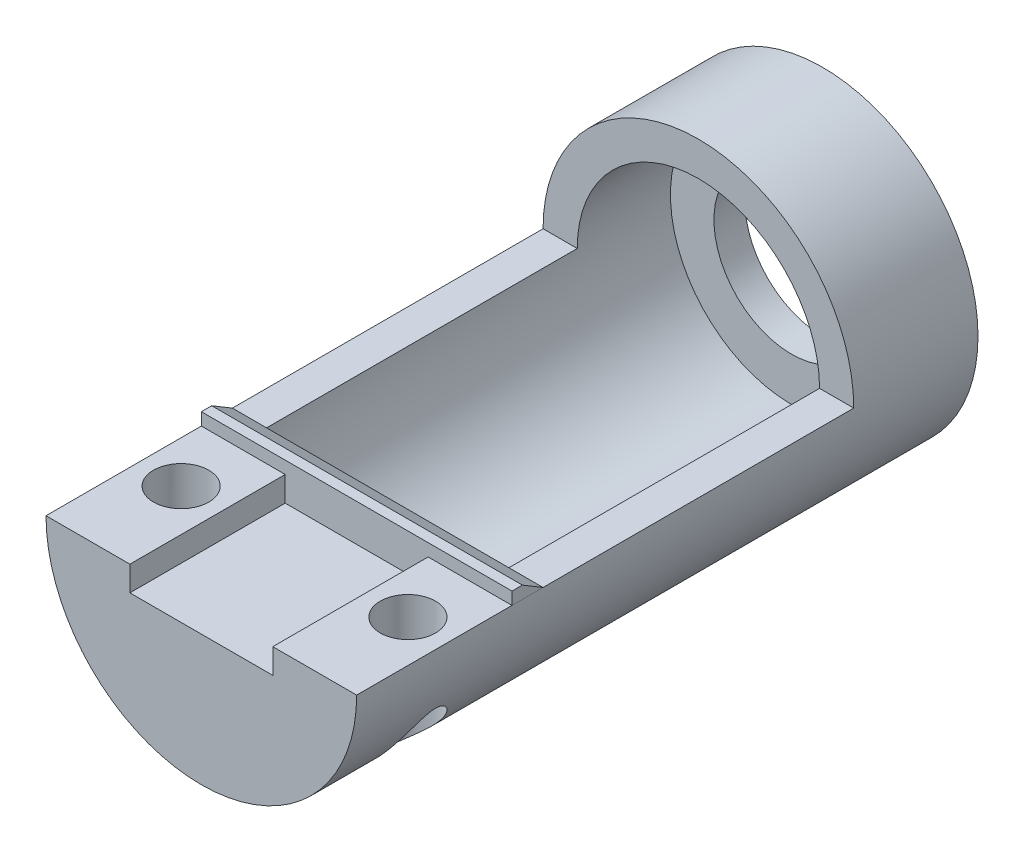
ISO-10303-21;
HEADER;
FILE_DESCRIPTION(('STEP AP214'),'2;1');
FILE_NAME('part.step','',(''),(''),'','','');
FILE_SCHEMA(('AUTOMOTIVE_DESIGN { 1 0 10303 214 1 1 1 1 }'));
ENDSEC;
DATA;
#1=APPLICATION_CONTEXT('core data for automotive mechanical design processes');
#2=APPLICATION_PROTOCOL_DEFINITION('international standard','automotive_design',2000,#1);
#3=PRODUCT_CONTEXT('',#1,'mechanical');
#4=PRODUCT('Part','Part','',(#3));
#5=PRODUCT_RELATED_PRODUCT_CATEGORY('part','',(#4));
#6=PRODUCT_DEFINITION_FORMATION('','',#4);
#7=PRODUCT_DEFINITION_CONTEXT('part definition',#1,'design');
#8=PRODUCT_DEFINITION('design','',#6,#7);
#9=PRODUCT_DEFINITION_SHAPE('','',#8);
#10=(LENGTH_UNIT() NAMED_UNIT(*) SI_UNIT(.MILLI.,.METRE.));
#11=(NAMED_UNIT(*) PLANE_ANGLE_UNIT() SI_UNIT($,.RADIAN.));
#12=(NAMED_UNIT(*) SI_UNIT($,.STERADIAN.) SOLID_ANGLE_UNIT());
#13=UNCERTAINTY_MEASURE_WITH_UNIT(LENGTH_MEASURE(1.E-05),#10,'distance_accuracy_value','');
#14=(GEOMETRIC_REPRESENTATION_CONTEXT(3) GLOBAL_UNCERTAINTY_ASSIGNED_CONTEXT((#13)) GLOBAL_UNIT_ASSIGNED_CONTEXT((#10,
#11,#12)) REPRESENTATION_CONTEXT('',''));
#15=CARTESIAN_POINT('',(0.,0.,0.));
#16=DIRECTION('',(0.,0.,1.));
#17=DIRECTION('',(1.,0.,0.));
#18=AXIS2_PLACEMENT_3D('',#15,#16,#17);
#19=CARTESIAN_POINT('',(0.,0.,0.));
#20=DIRECTION('',(0.,-1.,0.));
#21=DIRECTION('',(0.,0.,-1.));
#22=AXIS2_PLACEMENT_3D('',#19,#20,#21);
#23=PLANE('',#22);
#24=CARTESIAN_POINT('',(-4.6355,0.,8.89));
#25=DIRECTION('',(0.,1.,0.));
#26=DIRECTION('',(0.,0.,1.));
#27=AXIS2_PLACEMENT_3D('',#24,#25,#26);
#28=CIRCLE('',#27,1.1303);
#29=CARTESIAN_POINT('',(-4.6355,0.,10.0203));
#30=VERTEX_POINT('',#29);
#31=EDGE_CURVE('E174',#30,#30,#28,.T.);
#32=ORIENTED_EDGE('',*,*,#31,.F.);
#33=EDGE_LOOP('',(#32));
#34=FACE_BOUND('',#33,.T.);
#35=DIRECTION('',(-1.,0.,0.));
#36=VECTOR('',#35,1.);
#37=CARTESIAN_POINT('',(6.35,0.,6.35));
#38=LINE('',#37,#36);
#39=CARTESIAN_POINT('',(-2.921,0.,6.35));
#40=VERTEX_POINT('',#39);
#41=CARTESIAN_POINT('',(-6.35,0.,6.35));
#42=VERTEX_POINT('',#41);
#43=EDGE_CURVE('E160',#40,#42,#38,.T.);
#44=ORIENTED_EDGE('',*,*,#43,.T.);
#45=DIRECTION('',(0.,0.,1.));
#46=VECTOR('',#45,1.);
#47=CARTESIAN_POINT('',(-6.35,0.,12.7));
#48=LINE('',#47,#46);
#49=CARTESIAN_POINT('',(-6.35,0.,12.7));
#50=VERTEX_POINT('',#49);
#51=EDGE_CURVE('E216',#42,#50,#48,.T.);
#52=ORIENTED_EDGE('',*,*,#51,.T.);
#53=DIRECTION('',(1.,0.,0.));
#54=VECTOR('',#53,1.);
#55=CARTESIAN_POINT('',(-6.35,0.,12.7));
#56=LINE('',#55,#54);
#57=CARTESIAN_POINT('',(-2.921,0.,12.7));
#58=VERTEX_POINT('',#57);
#59=EDGE_CURVE('E221',#50,#58,#56,.T.);
#60=ORIENTED_EDGE('',*,*,#59,.T.);
#61=DIRECTION('',(0.,0.,1.));
#62=VECTOR('',#61,1.);
#63=CARTESIAN_POINT('',(-2.921,0.,6.35));
#64=LINE('',#63,#62);
#65=EDGE_CURVE('E193',#40,#58,#64,.T.);
#66=ORIENTED_EDGE('',*,*,#65,.F.);
#67=EDGE_LOOP('',(#44,#52,#60,#66));
#68=FACE_BOUND('',#67,.T.);
#69=ADVANCED_FACE('F33',(#34,#68),#23,.F.);
#70=CARTESIAN_POINT('',(4.6355,0.,8.89));
#71=DIRECTION('',(0.,1.,0.));
#72=DIRECTION('',(0.,0.,1.));
#73=AXIS2_PLACEMENT_3D('',#70,#71,#72);
#74=CIRCLE('',#73,1.1303);
#75=CARTESIAN_POINT('',(4.6355,0.,10.0203));
#76=VERTEX_POINT('',#75);
#77=EDGE_CURVE('E173',#76,#76,#74,.T.);
#78=ORIENTED_EDGE('',*,*,#77,.F.);
#79=EDGE_LOOP('',(#78));
#80=FACE_BOUND('',#79,.T.);
#81=CARTESIAN_POINT('',(6.35,0.,6.35));
#82=VERTEX_POINT('',#81);
#83=CARTESIAN_POINT('',(2.921,0.,6.35));
#84=VERTEX_POINT('',#83);
#85=EDGE_CURVE('E161',#82,#84,#38,.T.);
#86=ORIENTED_EDGE('',*,*,#85,.T.);
#87=DIRECTION('',(0.,0.,-1.));
#88=VECTOR('',#87,1.);
#89=CARTESIAN_POINT('',(2.921,0.,6.35));
#90=LINE('',#89,#88);
#91=CARTESIAN_POINT('',(2.921,0.,12.7));
#92=VERTEX_POINT('',#91);
#93=EDGE_CURVE('E183',#92,#84,#90,.T.);
#94=ORIENTED_EDGE('',*,*,#93,.F.);
#95=CARTESIAN_POINT('',(6.35,0.,12.7));
#96=VERTEX_POINT('',#95);
#97=EDGE_CURVE('E220',#92,#96,#56,.T.);
#98=ORIENTED_EDGE('',*,*,#97,.T.);
#99=DIRECTION('',(0.,0.,-1.));
#100=VECTOR('',#99,1.);
#101=CARTESIAN_POINT('',(6.35,0.,12.7));
#102=LINE('',#101,#100);
#103=EDGE_CURVE('E225',#96,#82,#102,.T.);
#104=ORIENTED_EDGE('',*,*,#103,.T.);
#105=EDGE_LOOP('',(#86,#94,#98,#104));
#106=FACE_BOUND('',#105,.T.);
#107=ADVANCED_FACE('F288',(#80,#106),#23,.F.);
#108=DIRECTION('',(-1.,0.,0.));
#109=VECTOR('',#108,1.);
#110=CARTESIAN_POINT('',(6.35,0.,5.08));
#111=LINE('',#110,#109);
#112=CARTESIAN_POINT('',(6.35,0.,5.08));
#113=VERTEX_POINT('',#112);
#114=CARTESIAN_POINT('',(4.953,0.,5.08));
#115=VERTEX_POINT('',#114);
#116=EDGE_CURVE('E49',#113,#115,#111,.T.);
#117=ORIENTED_EDGE('',*,*,#116,.F.);
#118=CARTESIAN_POINT('',(6.35,0.,-7.62));
#119=VERTEX_POINT('',#118);
#120=EDGE_CURVE('E224',#113,#119,#102,.T.);
#121=ORIENTED_EDGE('',*,*,#120,.T.);
#122=DIRECTION('',(-1.,0.,0.));
#123=VECTOR('',#122,1.);
#124=CARTESIAN_POINT('',(-6.35,0.,-7.62));
#125=LINE('',#124,#123);
#126=CARTESIAN_POINT('',(4.953,0.,-7.62));
#127=VERTEX_POINT('',#126);
#128=EDGE_CURVE('E166',#119,#127,#125,.T.);
#129=ORIENTED_EDGE('',*,*,#128,.T.);
#130=DIRECTION('',(0.,0.,-1.));
#131=VECTOR('',#130,1.);
#132=CARTESIAN_POINT('',(4.953,0.,1.27));
#133=LINE('',#132,#131);
#134=EDGE_CURVE('E231',#115,#127,#133,.T.);
#135=ORIENTED_EDGE('',*,*,#134,.F.);
#136=EDGE_LOOP('',(#117,#121,#129,#135));
#137=FACE_BOUND('',#136,.T.);
#138=ADVANCED_FACE('F318',(#137),#23,.F.);
#139=CARTESIAN_POINT('',(-4.953,0.,5.08));
#140=VERTEX_POINT('',#139);
#141=CARTESIAN_POINT('',(-6.35,0.,5.08));
#142=VERTEX_POINT('',#141);
#143=EDGE_CURVE('E140',#140,#142,#111,.T.);
#144=ORIENTED_EDGE('',*,*,#143,.F.);
#145=DIRECTION('',(0.,0.,-1.));
#146=VECTOR('',#145,1.);
#147=CARTESIAN_POINT('',(-4.953,0.,1.27));
#148=LINE('',#147,#146);
#149=CARTESIAN_POINT('',(-4.953,0.,-7.62));
#150=VERTEX_POINT('',#149);
#151=EDGE_CURVE('E235',#150,#140,#148,.F.);
#152=ORIENTED_EDGE('',*,*,#151,.F.);
#153=CARTESIAN_POINT('',(-6.35,0.,-7.62));
#154=VERTEX_POINT('',#153);
#155=EDGE_CURVE('E163',#150,#154,#125,.T.);
#156=ORIENTED_EDGE('',*,*,#155,.T.);
#157=EDGE_CURVE('E217',#154,#142,#48,.T.);
#158=ORIENTED_EDGE('',*,*,#157,.T.);
#159=EDGE_LOOP('',(#144,#152,#156,#158));
#160=FACE_BOUND('',#159,.T.);
#161=ADVANCED_FACE('F290',(#160),#23,.F.);
#162=CARTESIAN_POINT('',(0.,0.,12.7));
#163=DIRECTION('',(0.,0.,-1.));
#164=DIRECTION('',(-1.,0.,0.));
#165=AXIS2_PLACEMENT_3D('',#162,#163,#164);
#166=CYLINDRICAL_SURFACE('',#165,6.35);
#167=CARTESIAN_POINT('',(0.,0.,-12.7));
#168=DIRECTION('',(0.,0.,1.));
#169=DIRECTION('',(1.,0.,0.));
#170=AXIS2_PLACEMENT_3D('',#167,#168,#169);
#171=CIRCLE('',#170,6.35);
#172=CARTESIAN_POINT('',(6.35,0.,-12.7));
#173=VERTEX_POINT('',#172);
#174=EDGE_CURVE('E227',#173,#173,#171,.T.);
#175=ORIENTED_EDGE('',*,*,#174,.T.);
#176=EDGE_LOOP('',(#175));
#177=FACE_BOUND('',#176,.T.);
#178=CARTESIAN_POINT('',(4.6355,-4.33988937070981,10.0203));
#179=CARTESIAN_POINT('',(4.7317981195555,-4.23702016258493,10.0203070846714));
#180=CARTESIAN_POINT('',(4.82473310658209,-4.13082200540136,10.0080551662696));
#181=CARTESIAN_POINT('',(4.95721298495025,-3.96906685666005,9.9745114179702));
#182=CARTESIAN_POINT('',(5.00032112438613,-3.91459543133054,9.96074737871129));
#183=CARTESIAN_POINT('',(5.08407632867969,-3.80517969667276,9.92844605594135));
#184=CARTESIAN_POINT('',(5.12472445041039,-3.75023560216801,9.9099108404635));
#185=CARTESIAN_POINT('',(5.20474371543675,-3.63841061063036,9.86757753479949));
#186=CARTESIAN_POINT('',(5.24402747314658,-3.58152605344211,9.8436249590191));
#187=CARTESIAN_POINT('',(5.31970993047234,-3.46811592842018,9.79086752369285));
#188=CARTESIAN_POINT('',(5.35610974868163,-3.41159022929941,9.76206455914973));
#189=CARTESIAN_POINT('',(5.42587196739312,-3.29951029709393,9.69937726614571));
#190=CARTESIAN_POINT('',(5.45923543920413,-3.24395572700069,9.66549474115487));
#191=CARTESIAN_POINT('',(5.5226451625365,-3.13478227373508,9.59207079904354));
#192=CARTESIAN_POINT('',(5.55269559743166,-3.08116100834684,9.55253666658625));
#193=CARTESIAN_POINT('',(5.60814845928306,-2.97900095922728,9.46794851284085));
#194=CARTESIAN_POINT('',(5.63366352130757,-2.93035780293513,9.4230963361855));
#195=CARTESIAN_POINT('',(5.67999672881265,-2.83948556205968,9.32533103259018));
#196=CARTESIAN_POINT('',(5.70084620092967,-2.79721436091919,9.27247592678106));
#197=CARTESIAN_POINT('',(5.72590079385826,-2.74533966251904,9.18885876702329));
#198=CARTESIAN_POINT('',(5.7329163275276,-2.73063723612708,9.16214411095446));
#199=CARTESIAN_POINT('',(5.74520203779906,-2.70469152991185,9.10667168394196));
#200=CARTESIAN_POINT('',(5.75047291730592,-2.69344685712213,9.07791474150177));
#201=CARTESIAN_POINT('',(5.75890062038076,-2.67538177367741,9.01830720064192));
#202=CARTESIAN_POINT('',(5.76203106981831,-2.66861658973979,8.98743546535954));
#203=CARTESIAN_POINT('',(5.7656957579838,-2.66069051120866,8.92483848067153));
#204=CARTESIAN_POINT('',(5.76623377045598,-2.65952147046883,8.89311453953716));
#205=CARTESIAN_POINT('',(5.76474548435236,-2.66274478852809,8.83379044249772));
#206=CARTESIAN_POINT('',(5.76301375606368,-2.66649832301727,8.8061446782702));
#207=CARTESIAN_POINT('',(5.75766319282624,-2.67803183837211,8.75189589007085));
#208=CARTESIAN_POINT('',(5.75404237819982,-2.68581604313471,8.72529399152875));
#209=CARTESIAN_POINT('',(5.74331762903956,-2.70869319885164,8.662585049653));
#210=CARTESIAN_POINT('',(5.73538721837749,-2.72548661753856,8.62724847643128));
#211=CARTESIAN_POINT('',(5.71707947779703,-2.7636851411095,8.55986414646989));
#212=CARTESIAN_POINT('',(5.7066953735617,-2.78510299906944,8.52782585385821));
#213=CARTESIAN_POINT('',(5.67497819702779,-2.84942473774674,8.44219290294402));
#214=CARTESIAN_POINT('',(5.65155650065933,-2.89575426447407,8.39198686631537));
#215=CARTESIAN_POINT('',(5.60050217423546,-2.99331831474119,8.29910595183806));
#216=CARTESIAN_POINT('',(5.57285671538937,-3.04456759852021,8.25645490302063));
#217=CARTESIAN_POINT('',(5.5152258521071,-3.1477203451826,8.17873012061092));
#218=CARTESIAN_POINT('',(5.4853670321397,-3.19952724772415,8.1434322553428));
#219=CARTESIAN_POINT('',(5.42277325991151,-3.30450806741876,8.07769506747263));
#220=CARTESIAN_POINT('',(5.39003596474575,-3.35768307275366,8.04725976052873));
#221=CARTESIAN_POINT('',(5.32184485743326,-3.46475118913688,7.99085194954214));
#222=CARTESIAN_POINT('',(5.28638791360882,-3.51864506716537,7.96488470549351));
#223=CARTESIAN_POINT('',(5.21290926064005,-3.62661621904565,7.91732752622801));
#224=CARTESIAN_POINT('',(5.17488731197188,-3.68069350957573,7.89573800056492));
#225=CARTESIAN_POINT('',(5.094110350991,-3.79176932769674,7.85588352144479));
#226=CARTESIAN_POINT('',(5.05120887512431,-3.84875682634731,7.83788147556099));
#227=CARTESIAN_POINT('',(4.96280320062516,-3.9621049800824,7.80711374315982));
#228=CARTESIAN_POINT('',(4.9172983650518,-4.0184654777006,7.79434934438767));
#229=CARTESIAN_POINT('',(4.77731177357251,-4.18577871782472,7.76458581509027));
#230=CARTESIAN_POINT('',(4.67906032168491,-4.29537512042635,7.75596505593473));
#231=CARTESIAN_POINT('',(4.51046838915755,-4.47075064271935,7.76463703068144));
#232=CARTESIAN_POINT('',(4.44199536742775,-4.53875883022907,7.77411608656478));
#233=CARTESIAN_POINT('',(4.30378763011916,-4.67000221165943,7.80714347990802));
#234=CARTESIAN_POINT('',(4.23405457841624,-4.73324320051318,7.83067441506391));
#235=CARTESIAN_POINT('',(4.11045824792458,-4.84065100458429,7.88724368655142));
#236=CARTESIAN_POINT('',(4.05630654500846,-4.88605163263244,7.91729297381667));
#237=CARTESIAN_POINT('',(3.95102094047537,-4.97157011876135,7.98828867107826));
#238=CARTESIAN_POINT('',(3.89988345837849,-5.01169431725982,8.02922182030785));
#239=CARTESIAN_POINT('',(3.81185278337332,-5.07885736476856,8.1139673814861));
#240=CARTESIAN_POINT('',(3.77404166092956,-5.10695491239267,8.15598228035554));
#241=CARTESIAN_POINT('',(3.70398354291548,-5.15799219178976,8.24722661576546));
#242=CARTESIAN_POINT('',(3.67173496942523,-5.180933386819,8.29645399899911));
#243=CARTESIAN_POINT('',(3.61442285192259,-5.22108105039739,8.40155061988554));
#244=CARTESIAN_POINT('',(3.58940607206643,-5.23825030623541,8.45745992066158));
#245=CARTESIAN_POINT('',(3.54850131023035,-5.26604777555668,8.57405610989631));
#246=CARTESIAN_POINT('',(3.53260819741843,-5.27667966566599,8.63474029125143));
#247=CARTESIAN_POINT('',(3.51231446542766,-5.29020574328618,8.75163325893161));
#248=CARTESIAN_POINT('',(3.50681363003589,-5.2938415736569,8.80756759614924));
#249=CARTESIAN_POINT('',(3.50420131833056,-5.29557150771746,8.91970736824918));
#250=CARTESIAN_POINT('',(3.50708652234518,-5.29366780426982,8.97591268706754));
#251=CARTESIAN_POINT('',(3.52069643059532,-5.28462446859097,9.08390483652481));
#252=CARTESIAN_POINT('',(3.53100302450444,-5.27776402454279,9.13576897807041));
#253=CARTESIAN_POINT('',(3.55843456240417,-5.25930742392936,9.23676608235602));
#254=CARTESIAN_POINT('',(3.57555958952531,-5.24771120962541,9.2858990117887));
#255=CARTESIAN_POINT('',(3.61635623921156,-5.21968325954075,9.38163889329775));
#256=CARTESIAN_POINT('',(3.64019992479156,-5.20312358391236,9.42813452467909));
#257=CARTESIAN_POINT('',(3.69308584278814,-5.16572012475925,9.51615749850972));
#258=CARTESIAN_POINT('',(3.72212935459195,-5.14487528670754,9.55768361403353));
#259=CARTESIAN_POINT('',(3.78733565827849,-5.0970946741098,9.63911957243424));
#260=CARTESIAN_POINT('',(3.82391952892131,-5.06975885947667,9.67845563624605));
#261=CARTESIAN_POINT('',(3.90046170013335,-5.01111087686689,9.75026591276546));
#262=CARTESIAN_POINT('',(3.94042255615425,-4.97979568840475,9.78273486268445));
#263=CARTESIAN_POINT('',(4.04109075678548,-4.89876679981949,9.85415979283423));
#264=CARTESIAN_POINT('',(4.10296390628296,-4.8471654188371,9.88934408315276));
#265=CARTESIAN_POINT('',(4.22797285926771,-4.73852666274705,9.94652398612925));
#266=CARTESIAN_POINT('',(4.29111027057646,-4.68148196567415,9.96850153575825));
#267=CARTESIAN_POINT('',(4.40167953495852,-4.57734150045246,9.99695491749064));
#268=CARTESIAN_POINT('',(4.44929936487886,-4.53107739541189,10.0058658322924));
#269=CARTESIAN_POINT('',(4.54336441314329,-4.43675390057618,10.0175336670101));
#270=CARTESIAN_POINT('',(4.58981074204306,-4.38869632361334,10.0202966386324));
#271=CARTESIAN_POINT('',(4.6355,-4.33988937070981,10.0203));
#272=B_SPLINE_CURVE_WITH_KNOTS('',3,(#178,#179,#180,#181,#182,#183,#184,#185,#186,#187,#188,
#189,#190,#191,#192,#193,#194,#195,#196,#197,#198,#199,#200,#201,#202,#203,#204,#205,#206,#207,
#208,#209,#210,#211,#212,#213,#214,#215,#216,#217,#218,#219,#220,#221,#222,#223,#224,#225,#226,
#227,#228,#229,#230,#231,#232,#233,#234,#235,#236,#237,#238,#239,#240,#241,#242,#243,#244,#245,
#246,#247,#248,#249,#250,#251,#252,#253,#254,#255,#256,#257,#258,#259,#260,#261,#262,#263,#264,
#265,#266,#267,#268,#269,#270,#271),.UNSPECIFIED.,.T.,.F.,(4,2,2,2,2,2,2,2,2,2,2,2,2,2,2,2,2,2,
2,2,2,2,2,2,2,2,2,2,2,2,2,2,2,2,2,2,2,2,2,2,2,2,2,2,2,2,4),(0.,0.422440942350776,
0.634757148597898,0.846981482367927,1.06626158276659,1.28545621034477,1.50457319757879,
1.72341025782677,1.9356637118292,2.14644613391139,2.24008113096582,2.33367835731205,
2.42840904304122,2.52300178998802,2.60645304967701,2.68999193872315,2.80906790131935,
2.92847653899895,3.14392906267858,3.36004948805523,3.56806735232902,3.77625612630085,
3.98468833658038,4.1931400375738,4.41359078471682,4.63409570017882,5.07353210003355,
5.36356779129643,5.65324503567778,5.88276752404773,6.11201163630227,6.30060715139892,
6.48914907959113,6.67888424862784,6.86851261243538,7.03660475346813,7.20463036312537,
7.36386384575281,7.52309926981913,7.68685561058742,7.85065229816867,8.03077725380689,
8.21103975657798,8.47333267523786,8.73598352358475,8.93661090154175,9.13704070511141),.UNSPECIFIED.);
#273=CARTESIAN_POINT('',(4.6355,-4.33988937070981,10.0203));
#274=VERTEX_POINT('',#273);
#275=EDGE_CURVE('E177',#274,#274,#272,.T.);
#276=ORIENTED_EDGE('',*,*,#275,.T.);
#277=EDGE_LOOP('',(#276));
#278=FACE_BOUND('',#277,.T.);
#279=CARTESIAN_POINT('',(-4.6355,-4.33988937070981,10.0203));
#280=CARTESIAN_POINT('',(-4.57023285359232,-4.40961095207344,10.0202955139587));
#281=CARTESIAN_POINT('',(-4.50339958805493,-4.47782494633507,10.0146665942335));
#282=CARTESIAN_POINT('',(-4.36791056597807,-4.6100711941976,9.99031888967997));
#283=CARTESIAN_POINT('',(-4.29925658898056,-4.67410733364384,9.97161246369477));
#284=CARTESIAN_POINT('',(-4.17447160225519,-4.7856062224318,9.92376832042448));
#285=CARTESIAN_POINT('',(-4.11825986523783,-4.83400399938939,9.89704111571461));
#286=CARTESIAN_POINT('',(-4.00813214095895,-4.92569645770536,9.83236518622021));
#287=CARTESIAN_POINT('',(-3.9542136682538,-4.96899675864261,9.79442898361561));
#288=CARTESIAN_POINT('',(-3.86018956861797,-5.04225800174061,9.71437804158638));
#289=CARTESIAN_POINT('',(-3.81930537460205,-5.07323161637442,9.67411199111917));
#290=CARTESIAN_POINT('',(-3.74273432237871,-5.12998138847083,9.5856741576282));
#291=CARTESIAN_POINT('',(-3.70704607099362,-5.15575893985885,9.53750450117751));
#292=CARTESIAN_POINT('',(-3.64262367709391,-5.20147789197944,9.43363049562962));
#293=CARTESIAN_POINT('',(-3.61394119295076,-5.22137615330671,9.37787463331428));
#294=CARTESIAN_POINT('',(-3.56582060381178,-5.25435869089142,9.2606328799228));
#295=CARTESIAN_POINT('',(-3.54637603607125,-5.26744773141564,9.19915103080529));
#296=CARTESIAN_POINT('',(-3.51998387104971,-5.28511416483883,9.08078980523358));
#297=CARTESIAN_POINT('',(-3.51175939627589,-5.29056374609461,9.02432250437997));
#298=CARTESIAN_POINT('',(-3.50395149221631,-5.29573875971266,8.91054320597807));
#299=CARTESIAN_POINT('',(-3.50436392810411,-5.29546693113693,8.85323162575103));
#300=CARTESIAN_POINT('',(-3.51347921911194,-5.2894222184322,8.74343708712088));
#301=CARTESIAN_POINT('',(-3.52162930096491,-5.28401611539961,8.69088634991643));
#302=CARTESIAN_POINT('',(-3.54498112767384,-5.26837778645934,8.58813562887852));
#303=CARTESIAN_POINT('',(-3.56018250518494,-5.25814581196019,8.53793552273637));
#304=CARTESIAN_POINT('',(-3.59718064105527,-5.23290527006654,8.44028368854791));
#305=CARTESIAN_POINT('',(-3.61908599363871,-5.21781782670296,8.39289382669086));
#306=CARTESIAN_POINT('',(-3.66834645573346,-5.18330366571599,8.30277590367078));
#307=CARTESIAN_POINT('',(-3.69570288649811,-5.16387589592892,8.26004897662141));
#308=CARTESIAN_POINT('',(-3.7573614795726,-5.1192092954826,8.17628362758447));
#309=CARTESIAN_POINT('',(-3.79206580794059,-5.09360638882611,8.13573701248874));
#310=CARTESIAN_POINT('',(-3.86513502169851,-5.03838628112974,8.06123910748711));
#311=CARTESIAN_POINT('',(-3.90350212058369,-5.00876664808669,8.02729184382316));
#312=CARTESIAN_POINT('',(-3.99967326645699,-4.93257484106697,7.95275512748713));
#313=CARTESIAN_POINT('',(-4.05872745263534,-4.88419834165792,7.91560909306219));
#314=CARTESIAN_POINT('',(-4.17866945229663,-4.78199493088977,7.85392402892617));
#315=CARTESIAN_POINT('',(-4.23956052437152,-4.72815787802608,7.8294089906809));
#316=CARTESIAN_POINT('',(-4.38210275032242,-4.59695431251503,7.78514374145654));
#317=CARTESIAN_POINT('',(-4.46362491223751,-4.5179061268313,7.76999967577496));
#318=CARTESIAN_POINT('',(-4.62292034356662,-4.35478768699584,7.75693821590807));
#319=CARTESIAN_POINT('',(-4.70068737398924,-4.27070956176986,7.75904856129629));
#320=CARTESIAN_POINT('',(-4.82568602676018,-4.12807789595127,7.77467942358049));
#321=CARTESIAN_POINT('',(-4.87445113954994,-4.0703641870105,7.78415954402311));
#322=CARTESIAN_POINT('',(-4.96930123372654,-3.95400739049215,7.80900093746211));
#323=CARTESIAN_POINT('',(-5.01538625945778,-3.89536431831215,7.82436211311935));
#324=CARTESIAN_POINT('',(-5.10475447231643,-3.77749379188653,7.86057884531985));
#325=CARTESIAN_POINT('',(-5.14803312393679,-3.71826556158669,7.8814430327295));
#326=CARTESIAN_POINT('',(-5.23154711305567,-3.59981575102032,7.92843965549752));
#327=CARTESIAN_POINT('',(-5.27178364573742,-3.54059417736581,7.95457000694694));
#328=CARTESIAN_POINT('',(-5.36502522023023,-3.39836176998075,8.02396276035242));
#329=CARTESIAN_POINT('',(-5.41648534660903,-3.31557238724796,8.0698533304524));
#330=CARTESIAN_POINT('',(-5.48836412774286,-3.19414763558072,8.14741786512305));
#331=CARTESIAN_POINT('',(-5.5114031347783,-3.15419945363158,8.17467275190875));
#332=CARTESIAN_POINT('',(-5.55559775754249,-3.07568748484131,8.23248597662616));
#333=CARTESIAN_POINT('',(-5.5767546521067,-3.0371227687768,8.26304203976589));
#334=CARTESIAN_POINT('',(-5.61470453983413,-2.96631483838949,8.32441164815539));
#335=CARTESIAN_POINT('',(-5.63172131818436,-2.93384464345104,8.35482154921264));
#336=CARTESIAN_POINT('',(-5.66378332934996,-2.87146109920912,8.41934878960157));
#337=CARTESIAN_POINT('',(-5.67882324345328,-2.84155471997153,8.45347569642072));
#338=CARTESIAN_POINT('',(-5.70653630470865,-2.78548607113679,8.52665137387125));
#339=CARTESIAN_POINT('',(-5.71916566842396,-2.75939477447569,8.5657729062429));
#340=CARTESIAN_POINT('',(-5.74060737151987,-2.71450710825121,8.64890833436303));
#341=CARTESIAN_POINT('',(-5.74944372456473,-2.69566492560198,8.69288916602178));
#342=CARTESIAN_POINT('',(-5.75920219943179,-2.67472664685027,8.76517807767545));
#343=CARTESIAN_POINT('',(-5.76189247530352,-2.66891562499296,8.79216530488576));
#344=CARTESIAN_POINT('',(-5.76530622486,-2.66153371115445,8.84683898458361));
#345=CARTESIAN_POINT('',(-5.76603132814375,-2.65995930601048,8.87452483849933));
#346=CARTESIAN_POINT('',(-5.76543796942754,-2.66124505379608,8.92978391868643));
#347=CARTESIAN_POINT('',(-5.76411826759666,-2.66410789717208,8.95735706645496));
#348=CARTESIAN_POINT('',(-5.75957045770051,-2.67392527816352,9.01160290963765));
#349=CARTESIAN_POINT('',(-5.75634029029039,-2.68088423105234,9.03827460049997));
#350=CARTESIAN_POINT('',(-5.74671015397422,-2.7014797232522,9.10000150334274));
#351=CARTESIAN_POINT('',(-5.73957415951545,-2.71664485958612,9.13442470979992));
#352=CARTESIAN_POINT('',(-5.72292410750411,-2.75154803132109,9.20023530739845));
#353=CARTESIAN_POINT('',(-5.71340374242601,-2.771298185469,9.23161433517208));
#354=CARTESIAN_POINT('',(-5.6845769240835,-2.83016091290522,9.31445762954564));
#355=CARTESIAN_POINT('',(-5.66335795741717,-2.87252225643524,9.36290994922329));
#356=CARTESIAN_POINT('',(-5.61700251533748,-2.96215578236297,9.45284235478224));
#357=CARTESIAN_POINT('',(-5.59185417410768,-3.00944268973804,9.49430050427762));
#358=CARTESIAN_POINT('',(-5.538960010718,-3.10570055199108,9.57076946223963));
#359=CARTESIAN_POINT('',(-5.51127943615854,-3.15461567976045,9.6058968787551));
#360=CARTESIAN_POINT('',(-5.45322348975445,-3.25394699835062,9.6715543556187));
#361=CARTESIAN_POINT('',(-5.42284582297524,-3.30436444277404,9.70208043998784));
#362=CARTESIAN_POINT('',(-5.35955880746859,-3.40605658675842,9.7589812488399));
#363=CARTESIAN_POINT('',(-5.32664600338551,-3.45733237903024,9.7853501525899));
#364=CARTESIAN_POINT('',(-5.25844247872046,-3.56021005602774,9.83407470938624));
#365=CARTESIAN_POINT('',(-5.22315143095466,-3.61181198473266,9.85642980868206));
#366=CARTESIAN_POINT('',(-5.14601064660886,-3.72102721189634,9.89951961236671));
#367=CARTESIAN_POINT('',(-5.10387662477073,-3.77863752540281,9.9197587834536));
#368=CARTESIAN_POINT('',(-5.0168979173719,-3.89338454709121,9.95504325688991));
#369=CARTESIAN_POINT('',(-4.97205247611041,-3.95052111814356,9.97008710333396));
#370=CARTESIAN_POINT('',(-4.8338565330857,-4.12037016440963,10.0068301714277));
#371=CARTESIAN_POINT('',(-4.73655553220303,-4.23193687242334,10.0203069459034));
#372=CARTESIAN_POINT('',(-4.6355,-4.33988937070981,10.0203));
#373=B_SPLINE_CURVE_WITH_KNOTS('',3,(#279,#280,#281,#282,#283,#284,#285,#286,#287,#288,#289,
#290,#291,#292,#293,#294,#295,#296,#297,#298,#299,#300,#301,#302,#303,#304,#305,#306,#307,#308,
#309,#310,#311,#312,#313,#314,#315,#316,#317,#318,#319,#320,#321,#322,#323,#324,#325,#326,#327,
#328,#329,#330,#331,#332,#333,#334,#335,#336,#337,#338,#339,#340,#341,#342,#343,#344,#345,#346,
#347,#348,#349,#350,#351,#352,#353,#354,#355,#356,#357,#358,#359,#360,#361,#362,#363,#364,#365,
#366,#367,#368,#369,#370,#371,#372),.UNSPECIFIED.,.T.,.F.,(4,2,2,2,2,2,2,2,2,2,2,2,2,2,2,2,2,2,
2,2,2,2,2,2,2,2,2,2,2,2,2,2,2,2,2,2,2,2,2,2,2,2,2,2,2,2,4),(0.,0.28621805454198,
0.572165984908156,0.807868522859176,1.04330873393,1.23814843364237,1.43293579478435,
1.62911880855927,1.8251643720132,1.99622427958415,2.16720229596979,2.32681772180543,
2.48642483323683,2.64876801129637,2.81115058669142,2.98803911653719,3.16503522910002,
3.41831763692686,3.67207937512954,4.01390714418169,4.35628457086739,4.58446879144336,
4.81264923543575,5.04118970559768,5.26963991543485,5.59193788718871,5.75253127474893,
5.91301469721448,6.05571679877759,6.19879530379236,6.34426640842724,6.48880243806301,
6.57166032389559,6.65444947963241,6.7372888527367,6.820217683905,6.93442321274825,
7.04893410809831,7.25110060709076,7.45388984195604,7.65244216011743,7.85116507437285,
8.05016380831914,8.24918997537178,8.47150011656862,8.6938725061152,9.13703448606737),.UNSPECIFIED.);
#374=CARTESIAN_POINT('',(-4.6355,-4.33988937070981,10.0203));
#375=VERTEX_POINT('',#374);
#376=EDGE_CURVE('E195',#375,#375,#373,.T.);
#377=ORIENTED_EDGE('',*,*,#376,.T.);
#378=EDGE_LOOP('',(#377));
#379=FACE_BOUND('',#378,.T.);
#380=CARTESIAN_POINT('',(0.,0.,-7.62));
#381=DIRECTION('',(0.,0.,-1.));
#382=DIRECTION('',(-1.,0.,0.));
#383=AXIS2_PLACEMENT_3D('',#380,#381,#382);
#384=CIRCLE('',#383,6.35);
#385=EDGE_CURVE('E167',#154,#119,#384,.T.);
#386=ORIENTED_EDGE('',*,*,#385,.T.);
#387=ORIENTED_EDGE('',*,*,#120,.F.);
#388=DIRECTION('',(0.,0.,-1.));
#389=VECTOR('',#388,1.);
#390=CARTESIAN_POINT('',(6.35,0.,6.35));
#391=LINE('',#390,#389);
#392=EDGE_CURVE('E56',#82,#113,#391,.T.);
#393=ORIENTED_EDGE('',*,*,#392,.F.);
#394=ORIENTED_EDGE('',*,*,#103,.F.);
#395=CARTESIAN_POINT('',(0.,0.,12.7));
#396=DIRECTION('',(0.,0.,1.));
#397=DIRECTION('',(1.,0.,0.));
#398=AXIS2_PLACEMENT_3D('',#395,#396,#397);
#399=CIRCLE('',#398,6.35);
#400=EDGE_CURVE('E228',#50,#96,#399,.T.);
#401=ORIENTED_EDGE('',*,*,#400,.F.);
#402=ORIENTED_EDGE('',*,*,#51,.F.);
#403=DIRECTION('',(0.,0.,-1.));
#404=VECTOR('',#403,1.);
#405=CARTESIAN_POINT('',(-6.35,0.,6.35));
#406=LINE('',#405,#404);
#407=EDGE_CURVE('E153',#42,#142,#406,.T.);
#408=ORIENTED_EDGE('',*,*,#407,.T.);
#409=ORIENTED_EDGE('',*,*,#157,.F.);
#410=EDGE_LOOP('',(#386,#387,#393,#394,#401,#402,#408,#409));
#411=FACE_BOUND('',#410,.T.);
#412=ADVANCED_FACE('F35',(#177,#278,#379,#411),#166,.T.);
#413=CARTESIAN_POINT('',(0.,0.,1.27));
#414=DIRECTION('',(0.,0.,-1.));
#415=DIRECTION('',(-1.,0.,0.));
#416=AXIS2_PLACEMENT_3D('',#413,#414,#415);
#417=CYLINDRICAL_SURFACE('',#416,4.953);
#418=CARTESIAN_POINT('',(0.,0.,-11.43));
#419=DIRECTION('',(0.,0.,1.));
#420=DIRECTION('',(1.,0.,0.));
#421=AXIS2_PLACEMENT_3D('',#418,#419,#420);
#422=CIRCLE('',#421,4.953);
#423=CARTESIAN_POINT('',(4.953,0.,-11.43));
#424=VERTEX_POINT('',#423);
#425=EDGE_CURVE('E211',#424,#424,#422,.T.);
#426=ORIENTED_EDGE('',*,*,#425,.F.);
#427=EDGE_LOOP('',(#426));
#428=FACE_BOUND('',#427,.T.);
#429=ORIENTED_EDGE('',*,*,#134,.T.);
#430=CARTESIAN_POINT('',(0.,0.,-7.62));
#431=DIRECTION('',(0.,0.,-1.));
#432=DIRECTION('',(-1.,0.,0.));
#433=AXIS2_PLACEMENT_3D('',#430,#431,#432);
#434=CIRCLE('',#433,4.953);
#435=EDGE_CURVE('E11',#150,#127,#434,.T.);
#436=ORIENTED_EDGE('',*,*,#435,.F.);
#437=ORIENTED_EDGE('',*,*,#151,.T.);
#438=CARTESIAN_POINT('',(0.,0.,5.08));
#439=DIRECTION('',(0.,0.,1.));
#440=DIRECTION('',(1.,0.,0.));
#441=AXIS2_PLACEMENT_3D('',#438,#439,#440);
#442=CIRCLE('',#441,4.953);
#443=EDGE_CURVE('E170',#140,#115,#442,.T.);
#444=ORIENTED_EDGE('',*,*,#443,.T.);
#445=EDGE_LOOP('',(#429,#436,#437,#444));
#446=FACE_BOUND('',#445,.T.);
#447=ADVANCED_FACE('F281',(#428,#446),#417,.F.);
#448=CARTESIAN_POINT('',(0.,0.,12.7));
#449=DIRECTION('',(0.,0.,1.));
#450=DIRECTION('',(1.,0.,0.));
#451=AXIS2_PLACEMENT_3D('',#448,#449,#450);
#452=PLANE('',#451);
#453=DIRECTION('',(0.,1.,0.));
#454=VECTOR('',#453,1.);
#455=CARTESIAN_POINT('',(-2.921,-1.016,12.7));
#456=LINE('',#455,#454);
#457=CARTESIAN_POINT('',(-2.921,-1.016,12.7));
#458=VERTEX_POINT('',#457);
#459=EDGE_CURVE('E192',#458,#58,#456,.T.);
#460=ORIENTED_EDGE('',*,*,#459,.T.);
#461=ORIENTED_EDGE('',*,*,#59,.F.);
#462=ORIENTED_EDGE('',*,*,#400,.T.);
#463=ORIENTED_EDGE('',*,*,#97,.F.);
#464=DIRECTION('',(0.,1.,0.));
#465=VECTOR('',#464,1.);
#466=CARTESIAN_POINT('',(2.921,-1.016,12.7));
#467=LINE('',#466,#465);
#468=CARTESIAN_POINT('',(2.921,-1.016,12.7));
#469=VERTEX_POINT('',#468);
#470=EDGE_CURVE('E204',#469,#92,#467,.T.);
#471=ORIENTED_EDGE('',*,*,#470,.F.);
#472=DIRECTION('',(1.,0.,0.));
#473=VECTOR('',#472,1.);
#474=CARTESIAN_POINT('',(2.921,-1.016,12.7));
#475=LINE('',#474,#473);
#476=EDGE_CURVE('E182',#458,#469,#475,.T.);
#477=ORIENTED_EDGE('',*,*,#476,.F.);
#478=EDGE_LOOP('',(#460,#461,#462,#463,#471,#477));
#479=FACE_BOUND('',#478,.T.);
#480=ADVANCED_FACE('F284',(#479),#452,.T.);
#481=CARTESIAN_POINT('',(0.,0.,-12.7));
#482=DIRECTION('',(0.,0.,1.));
#483=DIRECTION('',(1.,0.,0.));
#484=AXIS2_PLACEMENT_3D('',#481,#482,#483);
#485=PLANE('',#484);
#486=CARTESIAN_POINT('',(0.,0.,-12.7));
#487=DIRECTION('',(0.,0.,1.));
#488=DIRECTION('',(1.,0.,0.));
#489=AXIS2_PLACEMENT_3D('',#486,#487,#488);
#490=CIRCLE('',#489,3.175);
#491=CARTESIAN_POINT('',(3.175,0.,-12.7));
#492=VERTEX_POINT('',#491);
#493=EDGE_CURVE('E208',#492,#492,#490,.T.);
#494=ORIENTED_EDGE('',*,*,#493,.T.);
#495=EDGE_LOOP('',(#494));
#496=FACE_BOUND('',#495,.T.);
#497=ORIENTED_EDGE('',*,*,#174,.F.);
#498=EDGE_LOOP('',(#497));
#499=FACE_BOUND('',#498,.T.);
#500=ADVANCED_FACE('F279',(#496,#499),#485,.F.);
#501=CARTESIAN_POINT('',(0.,0.,-11.43));
#502=DIRECTION('',(0.,0.,1.));
#503=DIRECTION('',(1.,0.,0.));
#504=AXIS2_PLACEMENT_3D('',#501,#502,#503);
#505=PLANE('',#504);
#506=CARTESIAN_POINT('',(0.,0.,-11.43));
#507=DIRECTION('',(0.,0.,1.));
#508=DIRECTION('',(1.,0.,0.));
#509=AXIS2_PLACEMENT_3D('',#506,#507,#508);
#510=CIRCLE('',#509,3.175);
#511=CARTESIAN_POINT('',(3.175,0.,-11.43));
#512=VERTEX_POINT('',#511);
#513=EDGE_CURVE('E200',#512,#512,#510,.T.);
#514=ORIENTED_EDGE('',*,*,#513,.F.);
#515=EDGE_LOOP('',(#514));
#516=FACE_BOUND('',#515,.T.);
#517=ORIENTED_EDGE('',*,*,#425,.T.);
#518=EDGE_LOOP('',(#517));
#519=FACE_BOUND('',#518,.T.);
#520=ADVANCED_FACE('F275',(#516,#519),#505,.T.);
#521=CARTESIAN_POINT('',(0.,0.,-12.7));
#522=DIRECTION('',(0.,0.,1.));
#523=DIRECTION('',(1.,0.,0.));
#524=AXIS2_PLACEMENT_3D('',#521,#522,#523);
#525=CYLINDRICAL_SURFACE('',#524,3.175);
#526=ORIENTED_EDGE('',*,*,#493,.F.);
#527=EDGE_LOOP('',(#526));
#528=FACE_BOUND('',#527,.T.);
#529=ORIENTED_EDGE('',*,*,#513,.T.);
#530=EDGE_LOOP('',(#529));
#531=FACE_BOUND('',#530,.T.);
#532=ADVANCED_FACE('F271',(#528,#531),#525,.F.);
#533=CARTESIAN_POINT('',(-2.921,-1.016,6.35));
#534=DIRECTION('',(-1.,0.,0.));
#535=DIRECTION('',(0.,0.,1.));
#536=AXIS2_PLACEMENT_3D('',#533,#534,#535);
#537=PLANE('',#536);
#538=ORIENTED_EDGE('',*,*,#65,.T.);
#539=ORIENTED_EDGE('',*,*,#459,.F.);
#540=DIRECTION('',(0.,0.,1.));
#541=VECTOR('',#540,1.);
#542=CARTESIAN_POINT('',(-2.921,-1.016,6.35));
#543=LINE('',#542,#541);
#544=CARTESIAN_POINT('',(-2.921,-1.016,6.35));
#545=VERTEX_POINT('',#544);
#546=EDGE_CURVE('E180',#545,#458,#543,.T.);
#547=ORIENTED_EDGE('',*,*,#546,.F.);
#548=DIRECTION('',(0.,1.,0.));
#549=VECTOR('',#548,1.);
#550=CARTESIAN_POINT('',(-2.921,-1.016,6.35));
#551=LINE('',#550,#549);
#552=EDGE_CURVE('E198',#545,#40,#551,.T.);
#553=ORIENTED_EDGE('',*,*,#552,.T.);
#554=EDGE_LOOP('',(#538,#539,#547,#553));
#555=FACE_BOUND('',#554,.T.);
#556=ADVANCED_FACE('F264',(#555),#537,.F.);
#557=CARTESIAN_POINT('',(2.921,-1.016,6.35));
#558=DIRECTION('',(0.,0.,-1.));
#559=DIRECTION('',(-1.,0.,0.));
#560=AXIS2_PLACEMENT_3D('',#557,#558,#559);
#561=PLANE('',#560);
#562=DIRECTION('',(0.,1.,0.));
#563=VECTOR('',#562,1.);
#564=CARTESIAN_POINT('',(2.921,-1.016,6.35));
#565=LINE('',#564,#563);
#566=CARTESIAN_POINT('',(2.921,-1.016,6.35));
#567=VERTEX_POINT('',#566);
#568=EDGE_CURVE('E201',#567,#84,#565,.T.);
#569=ORIENTED_EDGE('',*,*,#568,.T.);
#570=ORIENTED_EDGE('',*,*,#85,.F.);
#571=DIRECTION('',(0.,-1.,0.));
#572=VECTOR('',#571,1.);
#573=CARTESIAN_POINT('',(6.35,0.508,6.35));
#574=LINE('',#573,#572);
#575=CARTESIAN_POINT('',(6.35,0.508,6.35));
#576=VERTEX_POINT('',#575);
#577=EDGE_CURVE('E157',#576,#82,#574,.T.);
#578=ORIENTED_EDGE('',*,*,#577,.F.);
#579=DIRECTION('',(-1.,0.,0.));
#580=VECTOR('',#579,1.);
#581=CARTESIAN_POINT('',(6.35,0.508,6.35));
#582=LINE('',#581,#580);
#583=CARTESIAN_POINT('',(-6.35,0.508,6.35));
#584=VERTEX_POINT('',#583);
#585=EDGE_CURVE('E141',#576,#584,#582,.T.);
#586=ORIENTED_EDGE('',*,*,#585,.T.);
#587=DIRECTION('',(0.,-1.,0.));
#588=VECTOR('',#587,1.);
#589=CARTESIAN_POINT('',(-6.35,0.508,6.35));
#590=LINE('',#589,#588);
#591=EDGE_CURVE('E150',#584,#42,#590,.T.);
#592=ORIENTED_EDGE('',*,*,#591,.T.);
#593=ORIENTED_EDGE('',*,*,#43,.F.);
#594=ORIENTED_EDGE('',*,*,#552,.F.);
#595=DIRECTION('',(-1.,0.,0.));
#596=VECTOR('',#595,1.);
#597=CARTESIAN_POINT('',(2.921,-1.016,6.35));
#598=LINE('',#597,#596);
#599=EDGE_CURVE('E189',#567,#545,#598,.T.);
#600=ORIENTED_EDGE('',*,*,#599,.F.);
#601=EDGE_LOOP('',(#569,#570,#578,#586,#592,#593,#594,#600));
#602=FACE_BOUND('',#601,.T.);
#603=ADVANCED_FACE('F261',(#602),#561,.F.);
#604=CARTESIAN_POINT('',(2.921,-1.016,6.35));
#605=DIRECTION('',(1.,0.,0.));
#606=DIRECTION('',(0.,0.,-1.));
#607=AXIS2_PLACEMENT_3D('',#604,#605,#606);
#608=PLANE('',#607);
#609=ORIENTED_EDGE('',*,*,#93,.T.);
#610=ORIENTED_EDGE('',*,*,#568,.F.);
#611=DIRECTION('',(0.,0.,-1.));
#612=VECTOR('',#611,1.);
#613=CARTESIAN_POINT('',(2.921,-1.016,6.35));
#614=LINE('',#613,#612);
#615=EDGE_CURVE('E186',#469,#567,#614,.T.);
#616=ORIENTED_EDGE('',*,*,#615,.F.);
#617=ORIENTED_EDGE('',*,*,#470,.T.);
#618=EDGE_LOOP('',(#609,#610,#616,#617));
#619=FACE_BOUND('',#618,.T.);
#620=ADVANCED_FACE('F259',(#619),#608,.F.);
#621=CARTESIAN_POINT('',(0.,-1.016,0.));
#622=DIRECTION('',(0.,-1.,0.));
#623=DIRECTION('',(0.,0.,-1.));
#624=AXIS2_PLACEMENT_3D('',#621,#622,#623);
#625=PLANE('',#624);
#626=ORIENTED_EDGE('',*,*,#546,.T.);
#627=ORIENTED_EDGE('',*,*,#476,.T.);
#628=ORIENTED_EDGE('',*,*,#615,.T.);
#629=ORIENTED_EDGE('',*,*,#599,.T.);
#630=EDGE_LOOP('',(#626,#627,#628,#629));
#631=FACE_BOUND('',#630,.T.);
#632=ADVANCED_FACE('F253',(#631),#625,.F.);
#633=CARTESIAN_POINT('',(4.6355,-6.35,8.89));
#634=DIRECTION('',(0.,1.,0.));
#635=DIRECTION('',(0.,0.,1.));
#636=AXIS2_PLACEMENT_3D('',#633,#634,#635);
#637=CYLINDRICAL_SURFACE('',#636,1.1303);
#638=ORIENTED_EDGE('',*,*,#77,.T.);
#639=EDGE_LOOP('',(#638));
#640=FACE_BOUND('',#639,.T.);
#641=ORIENTED_EDGE('',*,*,#275,.F.);
#642=EDGE_LOOP('',(#641));
#643=FACE_BOUND('',#642,.T.);
#644=ADVANCED_FACE('F248',(#640,#643),#637,.F.);
#645=CARTESIAN_POINT('',(-4.6355,-6.35,8.89));
#646=DIRECTION('',(0.,1.,0.));
#647=DIRECTION('',(0.,0.,1.));
#648=AXIS2_PLACEMENT_3D('',#645,#646,#647);
#649=CYLINDRICAL_SURFACE('',#648,1.1303);
#650=ORIENTED_EDGE('',*,*,#31,.T.);
#651=EDGE_LOOP('',(#650));
#652=FACE_BOUND('',#651,.T.);
#653=ORIENTED_EDGE('',*,*,#376,.F.);
#654=EDGE_LOOP('',(#653));
#655=FACE_BOUND('',#654,.T.);
#656=ADVANCED_FACE('F252',(#652,#655),#649,.F.);
#657=CARTESIAN_POINT('',(0.,0.,5.08));
#658=DIRECTION('',(0.,0.,1.));
#659=DIRECTION('',(1.,0.,0.));
#660=AXIS2_PLACEMENT_3D('',#657,#658,#659);
#661=PLANE('',#660);
#662=ORIENTED_EDGE('',*,*,#443,.F.);
#663=DIRECTION('',(-1.,0.,0.));
#664=VECTOR('',#663,1.);
#665=CARTESIAN_POINT('',(0.,0.,5.08));
#666=LINE('',#665,#664);
#667=EDGE_CURVE('E42',#115,#140,#666,.T.);
#668=ORIENTED_EDGE('',*,*,#667,.F.);
#669=EDGE_LOOP('',(#662,#668));
#670=FACE_BOUND('',#669,.T.);
#671=ADVANCED_FACE('F321',(#670),#661,.F.);
#672=CARTESIAN_POINT('',(0.,0.,-7.62));
#673=DIRECTION('',(0.,0.,-1.));
#674=DIRECTION('',(-1.,0.,0.));
#675=AXIS2_PLACEMENT_3D('',#672,#673,#674);
#676=PLANE('',#675);
#677=ORIENTED_EDGE('',*,*,#155,.F.);
#678=ORIENTED_EDGE('',*,*,#435,.T.);
#679=ORIENTED_EDGE('',*,*,#128,.F.);
#680=ORIENTED_EDGE('',*,*,#385,.F.);
#681=EDGE_LOOP('',(#677,#678,#679,#680));
#682=FACE_BOUND('',#681,.T.);
#683=ADVANCED_FACE('F311',(#682),#676,.F.);
#684=CARTESIAN_POINT('',(6.35,0.,5.08));
#685=DIRECTION('',(0.,-0.857601641464446,0.514314519100412));
#686=DIRECTION('',(0.,-0.514314519100412,-0.857601641464446));
#687=AXIS2_PLACEMENT_3D('',#684,#685,#686);
#688=PLANE('',#687);
#689=DIRECTION('',(0.,0.514314519100412,0.857601641464446));
#690=VECTOR('',#689,1.);
#691=CARTESIAN_POINT('',(-6.35,0.,5.08));
#692=LINE('',#691,#690);
#693=CARTESIAN_POINT('',(-6.35,0.508,5.92707239963973));
#694=VERTEX_POINT('',#693);
#695=EDGE_CURVE('E137',#142,#694,#692,.T.);
#696=ORIENTED_EDGE('',*,*,#695,.T.);
#697=DIRECTION('',(-1.,0.,0.));
#698=VECTOR('',#697,1.);
#699=CARTESIAN_POINT('',(6.35,0.508,5.92707239963973));
#700=LINE('',#699,#698);
#701=CARTESIAN_POINT('',(6.35,0.508,5.92707239963973));
#702=VERTEX_POINT('',#701);
#703=EDGE_CURVE('E133',#702,#694,#700,.T.);
#704=ORIENTED_EDGE('',*,*,#703,.F.);
#705=DIRECTION('',(0.,0.514314519100412,0.857601641464446));
#706=VECTOR('',#705,1.);
#707=CARTESIAN_POINT('',(6.35,0.,5.08));
#708=LINE('',#707,#706);
#709=EDGE_CURVE('E123',#113,#702,#708,.T.);
#710=ORIENTED_EDGE('',*,*,#709,.F.);
#711=ORIENTED_EDGE('',*,*,#116,.T.);
#712=ORIENTED_EDGE('',*,*,#667,.T.);
#713=ORIENTED_EDGE('',*,*,#143,.T.);
#714=EDGE_LOOP('',(#696,#704,#710,#711,#712,#713));
#715=FACE_BOUND('',#714,.T.);
#716=ADVANCED_FACE('F134',(#715),#688,.F.);
#717=CARTESIAN_POINT('',(6.35,0.508,5.92707239963973));
#718=DIRECTION('',(0.,-1.,0.));
#719=DIRECTION('',(0.,0.,-1.));
#720=AXIS2_PLACEMENT_3D('',#717,#718,#719);
#721=PLANE('',#720);
#722=DIRECTION('',(0.,0.,1.));
#723=VECTOR('',#722,1.);
#724=CARTESIAN_POINT('',(-6.35,0.508,5.92707239963973));
#725=LINE('',#724,#723);
#726=EDGE_CURVE('E156',#694,#584,#725,.T.);
#727=ORIENTED_EDGE('',*,*,#726,.T.);
#728=ORIENTED_EDGE('',*,*,#585,.F.);
#729=DIRECTION('',(0.,0.,1.));
#730=VECTOR('',#729,1.);
#731=CARTESIAN_POINT('',(6.35,0.508,5.92707239963973));
#732=LINE('',#731,#730);
#733=EDGE_CURVE('E128',#702,#576,#732,.T.);
#734=ORIENTED_EDGE('',*,*,#733,.F.);
#735=ORIENTED_EDGE('',*,*,#703,.T.);
#736=EDGE_LOOP('',(#727,#728,#734,#735));
#737=FACE_BOUND('',#736,.T.);
#738=ADVANCED_FACE('F143',(#737),#721,.F.);
#739=CARTESIAN_POINT('',(6.35,0.,0.));
#740=DIRECTION('',(1.,0.,0.));
#741=DIRECTION('',(0.,0.,-1.));
#742=AXIS2_PLACEMENT_3D('',#739,#740,#741);
#743=PLANE('',#742);
#744=ORIENTED_EDGE('',*,*,#577,.T.);
#745=ORIENTED_EDGE('',*,*,#392,.T.);
#746=ORIENTED_EDGE('',*,*,#709,.T.);
#747=ORIENTED_EDGE('',*,*,#733,.T.);
#748=EDGE_LOOP('',(#744,#745,#746,#747));
#749=FACE_BOUND('',#748,.T.);
#750=ADVANCED_FACE('F126',(#749),#743,.T.);
#751=CARTESIAN_POINT('',(-6.35,0.,0.));
#752=DIRECTION('',(1.,0.,0.));
#753=DIRECTION('',(0.,0.,-1.));
#754=AXIS2_PLACEMENT_3D('',#751,#752,#753);
#755=PLANE('',#754);
#756=ORIENTED_EDGE('',*,*,#591,.F.);
#757=ORIENTED_EDGE('',*,*,#726,.F.);
#758=ORIENTED_EDGE('',*,*,#695,.F.);
#759=ORIENTED_EDGE('',*,*,#407,.F.);
#760=EDGE_LOOP('',(#756,#757,#758,#759));
#761=FACE_BOUND('',#760,.T.);
#762=ADVANCED_FACE('F325',(#761),#755,.F.);
#763=CLOSED_SHELL('',(#69,#107,#138,#161,#412,#447,#480,#500,#520,#532,#556,#603,#620,#632,#644,
#656,#671,#683,#716,#738,#750,#762));
#764=MANIFOLD_SOLID_BREP('B2',#763);
#765=ADVANCED_BREP_SHAPE_REPRESENTATION('',(#18,#764),#14);
#766=SHAPE_DEFINITION_REPRESENTATION(#9,#765);
ENDSEC;
END-ISO-10303-21;
